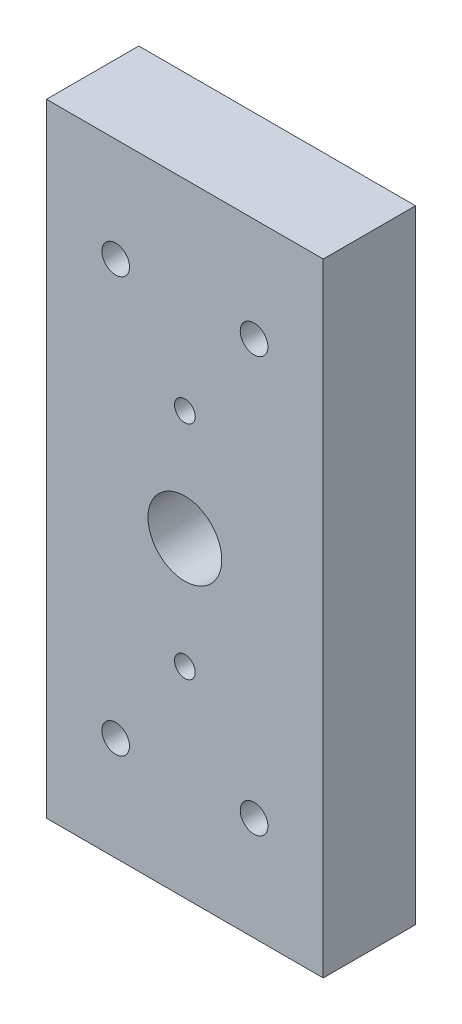
ISO-10303-21;
HEADER;
FILE_DESCRIPTION(('STEP AP214'),'2;1');
FILE_NAME('part.step','',(''),(''),'','','');
FILE_SCHEMA(('AUTOMOTIVE_DESIGN { 1 0 10303 214 1 1 1 1 }'));
ENDSEC;
DATA;
#1=APPLICATION_CONTEXT('core data for automotive mechanical design processes');
#2=APPLICATION_PROTOCOL_DEFINITION('international standard','automotive_design',2000,#1);
#3=PRODUCT_CONTEXT('',#1,'mechanical');
#4=PRODUCT('Part','Part','',(#3));
#5=PRODUCT_RELATED_PRODUCT_CATEGORY('part','',(#4));
#6=PRODUCT_DEFINITION_FORMATION('','',#4);
#7=PRODUCT_DEFINITION_CONTEXT('part definition',#1,'design');
#8=PRODUCT_DEFINITION('design','',#6,#7);
#9=PRODUCT_DEFINITION_SHAPE('','',#8);
#10=(LENGTH_UNIT() NAMED_UNIT(*) SI_UNIT(.MILLI.,.METRE.));
#11=(NAMED_UNIT(*) PLANE_ANGLE_UNIT() SI_UNIT($,.RADIAN.));
#12=(NAMED_UNIT(*) SI_UNIT($,.STERADIAN.) SOLID_ANGLE_UNIT());
#13=UNCERTAINTY_MEASURE_WITH_UNIT(LENGTH_MEASURE(1.E-05),#10,'distance_accuracy_value','');
#14=(GEOMETRIC_REPRESENTATION_CONTEXT(3) GLOBAL_UNCERTAINTY_ASSIGNED_CONTEXT((#13)) GLOBAL_UNIT_ASSIGNED_CONTEXT((#10,
#11,#12)) REPRESENTATION_CONTEXT('',''));
#15=CARTESIAN_POINT('',(0.,0.,0.));
#16=DIRECTION('',(0.,0.,1.));
#17=DIRECTION('',(1.,0.,0.));
#18=AXIS2_PLACEMENT_3D('',#15,#16,#17);
#19=CARTESIAN_POINT('',(5.,22.5,20.));
#20=DIRECTION('',(0.,0.,-1.));
#21=DIRECTION('',(-1.,0.,0.));
#22=AXIS2_PLACEMENT_3D('',#19,#20,#21);
#23=CYLINDRICAL_SURFACE('',#22,3.);
#24=CARTESIAN_POINT('',(5.,22.5,20.));
#25=DIRECTION('',(0.,0.,1.));
#26=DIRECTION('',(1.,0.,0.));
#27=AXIS2_PLACEMENT_3D('',#24,#25,#26);
#28=CIRCLE('',#27,3.);
#29=CARTESIAN_POINT('',(8.,22.5,20.));
#30=VERTEX_POINT('',#29);
#31=EDGE_CURVE('E107',#30,#30,#28,.T.);
#32=ORIENTED_EDGE('',*,*,#31,.T.);
#33=EDGE_LOOP('',(#32));
#34=FACE_BOUND('',#33,.T.);
#35=CARTESIAN_POINT('',(5.,22.5,6.));
#36=DIRECTION('',(0.,0.,-1.));
#37=DIRECTION('',(-1.,0.,0.));
#38=AXIS2_PLACEMENT_3D('',#35,#36,#37);
#39=CIRCLE('',#38,3.);
#40=CARTESIAN_POINT('',(2.,22.5,6.));
#41=VERTEX_POINT('',#40);
#42=EDGE_CURVE('E32',#41,#41,#39,.T.);
#43=ORIENTED_EDGE('',*,*,#42,.T.);
#44=EDGE_LOOP('',(#43));
#45=FACE_BOUND('',#44,.T.);
#46=ADVANCED_FACE('F28',(#34,#45),#23,.F.);
#47=CARTESIAN_POINT('',(35.,22.5,20.));
#48=DIRECTION('',(0.,0.,-1.));
#49=DIRECTION('',(-1.,0.,0.));
#50=AXIS2_PLACEMENT_3D('',#47,#48,#49);
#51=CYLINDRICAL_SURFACE('',#50,3.);
#52=CARTESIAN_POINT('',(35.,22.5,20.));
#53=DIRECTION('',(0.,0.,1.));
#54=DIRECTION('',(1.,0.,0.));
#55=AXIS2_PLACEMENT_3D('',#52,#53,#54);
#56=CIRCLE('',#55,3.);
#57=CARTESIAN_POINT('',(38.,22.5,20.));
#58=VERTEX_POINT('',#57);
#59=EDGE_CURVE('E104',#58,#58,#56,.T.);
#60=ORIENTED_EDGE('',*,*,#59,.T.);
#61=EDGE_LOOP('',(#60));
#62=FACE_BOUND('',#61,.T.);
#63=CARTESIAN_POINT('',(35.,22.5,6.));
#64=DIRECTION('',(0.,0.,-1.));
#65=DIRECTION('',(-1.,0.,0.));
#66=AXIS2_PLACEMENT_3D('',#63,#64,#65);
#67=CIRCLE('',#66,3.);
#68=CARTESIAN_POINT('',(32.,22.5,6.));
#69=VERTEX_POINT('',#68);
#70=EDGE_CURVE('E135',#69,#69,#67,.T.);
#71=ORIENTED_EDGE('',*,*,#70,.T.);
#72=EDGE_LOOP('',(#71));
#73=FACE_BOUND('',#72,.T.);
#74=ADVANCED_FACE('F174',(#62,#73),#51,.F.);
#75=CARTESIAN_POINT('',(5.,112.5,20.));
#76=DIRECTION('',(0.,0.,-1.));
#77=DIRECTION('',(-1.,0.,0.));
#78=AXIS2_PLACEMENT_3D('',#75,#76,#77);
#79=CYLINDRICAL_SURFACE('',#78,3.);
#80=CARTESIAN_POINT('',(5.,112.5,20.));
#81=DIRECTION('',(0.,0.,1.));
#82=DIRECTION('',(1.,0.,0.));
#83=AXIS2_PLACEMENT_3D('',#80,#81,#82);
#84=CIRCLE('',#83,3.);
#85=CARTESIAN_POINT('',(8.,112.5,20.));
#86=VERTEX_POINT('',#85);
#87=EDGE_CURVE('E113',#86,#86,#84,.T.);
#88=ORIENTED_EDGE('',*,*,#87,.T.);
#89=EDGE_LOOP('',(#88));
#90=FACE_BOUND('',#89,.T.);
#91=CARTESIAN_POINT('',(5.,112.5,6.));
#92=DIRECTION('',(0.,0.,-1.));
#93=DIRECTION('',(-1.,0.,0.));
#94=AXIS2_PLACEMENT_3D('',#91,#92,#93);
#95=CIRCLE('',#94,3.);
#96=CARTESIAN_POINT('',(2.,112.5,6.));
#97=VERTEX_POINT('',#96);
#98=EDGE_CURVE('E131',#97,#97,#95,.T.);
#99=ORIENTED_EDGE('',*,*,#98,.T.);
#100=EDGE_LOOP('',(#99));
#101=FACE_BOUND('',#100,.T.);
#102=ADVANCED_FACE('F180',(#90,#101),#79,.F.);
#103=CARTESIAN_POINT('',(35.,112.5,20.));
#104=DIRECTION('',(0.,0.,-1.));
#105=DIRECTION('',(-1.,0.,0.));
#106=AXIS2_PLACEMENT_3D('',#103,#104,#105);
#107=CYLINDRICAL_SURFACE('',#106,3.);
#108=CARTESIAN_POINT('',(35.,112.5,20.));
#109=DIRECTION('',(0.,0.,1.));
#110=DIRECTION('',(1.,0.,0.));
#111=AXIS2_PLACEMENT_3D('',#108,#109,#110);
#112=CIRCLE('',#111,3.);
#113=CARTESIAN_POINT('',(38.,112.5,20.));
#114=VERTEX_POINT('',#113);
#115=EDGE_CURVE('E110',#114,#114,#112,.T.);
#116=ORIENTED_EDGE('',*,*,#115,.T.);
#117=EDGE_LOOP('',(#116));
#118=FACE_BOUND('',#117,.T.);
#119=CARTESIAN_POINT('',(35.,112.5,6.));
#120=DIRECTION('',(0.,0.,-1.));
#121=DIRECTION('',(-1.,0.,0.));
#122=AXIS2_PLACEMENT_3D('',#119,#120,#121);
#123=CIRCLE('',#122,3.);
#124=CARTESIAN_POINT('',(32.,112.5,6.));
#125=VERTEX_POINT('',#124);
#126=EDGE_CURVE('E127',#125,#125,#123,.T.);
#127=ORIENTED_EDGE('',*,*,#126,.T.);
#128=EDGE_LOOP('',(#127));
#129=FACE_BOUND('',#128,.T.);
#130=ADVANCED_FACE('F185',(#118,#129),#107,.F.);
#131=CARTESIAN_POINT('',(-10.,-47.5506246430063,20.));
#132=DIRECTION('',(1.,0.,0.));
#133=DIRECTION('',(0.,0.,-1.));
#134=AXIS2_PLACEMENT_3D('',#131,#132,#133);
#135=PLANE('',#134);
#136=DIRECTION('',(0.,-1.,0.));
#137=VECTOR('',#136,1.);
#138=CARTESIAN_POINT('',(-10.,-47.5506246430063,0.));
#139=LINE('',#138,#137);
#140=CARTESIAN_POINT('',(-10.,135.,0.));
#141=VERTEX_POINT('',#140);
#142=CARTESIAN_POINT('',(-10.,0.,0.));
#143=VERTEX_POINT('',#142);
#144=EDGE_CURVE('E75',#141,#143,#139,.T.);
#145=ORIENTED_EDGE('',*,*,#144,.T.);
#146=DIRECTION('',(0.,0.,-1.));
#147=VECTOR('',#146,1.);
#148=CARTESIAN_POINT('',(-10.,0.,20.));
#149=LINE('',#148,#147);
#150=CARTESIAN_POINT('',(-10.,0.,20.));
#151=VERTEX_POINT('',#150);
#152=EDGE_CURVE('E11',#151,#143,#149,.T.);
#153=ORIENTED_EDGE('',*,*,#152,.F.);
#154=DIRECTION('',(0.,-1.,0.));
#155=VECTOR('',#154,1.);
#156=CARTESIAN_POINT('',(-10.,-47.5506246430063,20.));
#157=LINE('',#156,#155);
#158=CARTESIAN_POINT('',(-10.,135.,20.));
#159=VERTEX_POINT('',#158);
#160=EDGE_CURVE('E116',#159,#151,#157,.T.);
#161=ORIENTED_EDGE('',*,*,#160,.F.);
#162=DIRECTION('',(0.,0.,-1.));
#163=VECTOR('',#162,1.);
#164=CARTESIAN_POINT('',(-10.,135.,20.));
#165=LINE('',#164,#163);
#166=EDGE_CURVE('E45',#159,#141,#165,.T.);
#167=ORIENTED_EDGE('',*,*,#166,.T.);
#168=EDGE_LOOP('',(#145,#153,#161,#167));
#169=FACE_BOUND('',#168,.T.);
#170=ADVANCED_FACE('F87',(#169),#135,.F.);
#171=CARTESIAN_POINT('',(20.,0.,20.));
#172=DIRECTION('',(0.,1.,0.));
#173=DIRECTION('',(0.,0.,1.));
#174=AXIS2_PLACEMENT_3D('',#171,#172,#173);
#175=PLANE('',#174);
#176=DIRECTION('',(0.,0.,-1.));
#177=VECTOR('',#176,1.);
#178=CARTESIAN_POINT('',(50.,0.,20.));
#179=LINE('',#178,#177);
#180=CARTESIAN_POINT('',(50.,0.,20.));
#181=VERTEX_POINT('',#180);
#182=CARTESIAN_POINT('',(50.,0.,0.));
#183=VERTEX_POINT('',#182);
#184=EDGE_CURVE('E37',#181,#183,#179,.T.);
#185=ORIENTED_EDGE('',*,*,#184,.F.);
#186=DIRECTION('',(1.,0.,0.));
#187=VECTOR('',#186,1.);
#188=CARTESIAN_POINT('',(20.,0.,20.));
#189=LINE('',#188,#187);
#190=EDGE_CURVE('E84',#151,#181,#189,.T.);
#191=ORIENTED_EDGE('',*,*,#190,.F.);
#192=ORIENTED_EDGE('',*,*,#152,.T.);
#193=DIRECTION('',(1.,0.,0.));
#194=VECTOR('',#193,1.);
#195=CARTESIAN_POINT('',(20.,0.,0.));
#196=LINE('',#195,#194);
#197=EDGE_CURVE('E71',#143,#183,#196,.T.);
#198=ORIENTED_EDGE('',*,*,#197,.T.);
#199=EDGE_LOOP('',(#185,#191,#192,#198));
#200=FACE_BOUND('',#199,.T.);
#201=ADVANCED_FACE('F83',(#200),#175,.F.);
#202=CARTESIAN_POINT('',(50.,-47.5506246430063,20.));
#203=DIRECTION('',(1.,0.,0.));
#204=DIRECTION('',(0.,0.,-1.));
#205=AXIS2_PLACEMENT_3D('',#202,#203,#204);
#206=PLANE('',#205);
#207=DIRECTION('',(0.,-1.,0.));
#208=VECTOR('',#207,1.);
#209=CARTESIAN_POINT('',(50.,-47.5506246430063,0.));
#210=LINE('',#209,#208);
#211=CARTESIAN_POINT('',(50.,135.,0.));
#212=VERTEX_POINT('',#211);
#213=EDGE_CURVE('E77',#212,#183,#210,.T.);
#214=ORIENTED_EDGE('',*,*,#213,.F.);
#215=DIRECTION('',(0.,0.,-1.));
#216=VECTOR('',#215,1.);
#217=CARTESIAN_POINT('',(50.,135.,20.));
#218=LINE('',#217,#216);
#219=CARTESIAN_POINT('',(50.,135.,20.));
#220=VERTEX_POINT('',#219);
#221=EDGE_CURVE('E124',#220,#212,#218,.T.);
#222=ORIENTED_EDGE('',*,*,#221,.F.);
#223=DIRECTION('',(0.,-1.,0.));
#224=VECTOR('',#223,1.);
#225=CARTESIAN_POINT('',(50.,-47.5506246430063,20.));
#226=LINE('',#225,#224);
#227=EDGE_CURVE('E119',#220,#181,#226,.T.);
#228=ORIENTED_EDGE('',*,*,#227,.T.);
#229=ORIENTED_EDGE('',*,*,#184,.T.);
#230=EDGE_LOOP('',(#214,#222,#228,#229));
#231=FACE_BOUND('',#230,.T.);
#232=ADVANCED_FACE('F172',(#231),#206,.T.);
#233=CARTESIAN_POINT('',(20.0001310269614,91.4999437200018,20.));
#234=DIRECTION('',(0.,0.,-1.));
#235=DIRECTION('',(-1.,0.,0.));
#236=AXIS2_PLACEMENT_3D('',#233,#234,#235);
#237=CYLINDRICAL_SURFACE('',#236,2.25);
#238=CARTESIAN_POINT('',(20.0001310269614,91.4999437200018,20.));
#239=DIRECTION('',(0.,0.,1.));
#240=DIRECTION('',(1.,0.,0.));
#241=AXIS2_PLACEMENT_3D('',#238,#239,#240);
#242=CIRCLE('',#241,2.25);
#243=CARTESIAN_POINT('',(22.2501310269614,91.4999437200018,20.));
#244=VERTEX_POINT('',#243);
#245=EDGE_CURVE('E101',#244,#244,#242,.T.);
#246=ORIENTED_EDGE('',*,*,#245,.T.);
#247=EDGE_LOOP('',(#246));
#248=FACE_BOUND('',#247,.T.);
#249=CARTESIAN_POINT('',(20.0001310269614,91.4999437200018,0.));
#250=DIRECTION('',(0.,0.,1.));
#251=DIRECTION('',(1.,0.,0.));
#252=AXIS2_PLACEMENT_3D('',#249,#250,#251);
#253=CIRCLE('',#252,2.25);
#254=CARTESIAN_POINT('',(22.2501310269614,91.4999437200018,0.));
#255=VERTEX_POINT('',#254);
#256=EDGE_CURVE('E88',#255,#255,#253,.T.);
#257=ORIENTED_EDGE('',*,*,#256,.F.);
#258=EDGE_LOOP('',(#257));
#259=FACE_BOUND('',#258,.T.);
#260=ADVANCED_FACE('F163',(#248,#259),#237,.F.);
#261=CARTESIAN_POINT('',(20.0001310269613,43.4999345889699,20.));
#262=DIRECTION('',(0.,0.,-1.));
#263=DIRECTION('',(-1.,0.,0.));
#264=AXIS2_PLACEMENT_3D('',#261,#262,#263);
#265=CYLINDRICAL_SURFACE('',#264,2.25);
#266=CARTESIAN_POINT('',(20.0001310269613,43.4999345889699,20.));
#267=DIRECTION('',(0.,0.,1.));
#268=DIRECTION('',(1.,0.,0.));
#269=AXIS2_PLACEMENT_3D('',#266,#267,#268);
#270=CIRCLE('',#269,2.25);
#271=CARTESIAN_POINT('',(22.2501310269613,43.4999345889699,20.));
#272=VERTEX_POINT('',#271);
#273=EDGE_CURVE('E98',#272,#272,#270,.T.);
#274=ORIENTED_EDGE('',*,*,#273,.T.);
#275=EDGE_LOOP('',(#274));
#276=FACE_BOUND('',#275,.T.);
#277=CARTESIAN_POINT('',(20.0001310269613,43.4999345889699,0.));
#278=DIRECTION('',(0.,0.,1.));
#279=DIRECTION('',(1.,0.,0.));
#280=AXIS2_PLACEMENT_3D('',#277,#278,#279);
#281=CIRCLE('',#280,2.25);
#282=CARTESIAN_POINT('',(22.2501310269613,43.4999345889699,0.));
#283=VERTEX_POINT('',#282);
#284=EDGE_CURVE('E91',#283,#283,#281,.T.);
#285=ORIENTED_EDGE('',*,*,#284,.F.);
#286=EDGE_LOOP('',(#285));
#287=FACE_BOUND('',#286,.T.);
#288=ADVANCED_FACE('F30',(#276,#287),#265,.F.);
#289=CARTESIAN_POINT('',(20.,135.,20.));
#290=DIRECTION('',(0.,1.,0.));
#291=DIRECTION('',(0.,0.,1.));
#292=AXIS2_PLACEMENT_3D('',#289,#290,#291);
#293=PLANE('',#292);
#294=ORIENTED_EDGE('',*,*,#221,.T.);
#295=DIRECTION('',(1.,0.,0.));
#296=VECTOR('',#295,1.);
#297=CARTESIAN_POINT('',(20.,135.,0.));
#298=LINE('',#297,#296);
#299=EDGE_CURVE('E96',#141,#212,#298,.T.);
#300=ORIENTED_EDGE('',*,*,#299,.F.);
#301=ORIENTED_EDGE('',*,*,#166,.F.);
#302=DIRECTION('',(1.,0.,0.));
#303=VECTOR('',#302,1.);
#304=CARTESIAN_POINT('',(20.,135.,20.));
#305=LINE('',#304,#303);
#306=EDGE_CURVE('E50',#159,#220,#305,.T.);
#307=ORIENTED_EDGE('',*,*,#306,.T.);
#308=EDGE_LOOP('',(#294,#300,#301,#307));
#309=FACE_BOUND('',#308,.T.);
#310=ADVANCED_FACE('F162',(#309),#293,.T.);
#311=CARTESIAN_POINT('',(20.,-47.5506246430063,20.));
#312=DIRECTION('',(0.,0.,1.));
#313=DIRECTION('',(1.,0.,0.));
#314=AXIS2_PLACEMENT_3D('',#311,#312,#313);
#315=PLANE('',#314);
#316=ORIENTED_EDGE('',*,*,#227,.F.);
#317=ORIENTED_EDGE('',*,*,#306,.F.);
#318=ORIENTED_EDGE('',*,*,#160,.T.);
#319=ORIENTED_EDGE('',*,*,#190,.T.);
#320=EDGE_LOOP('',(#316,#317,#318,#319));
#321=FACE_BOUND('',#320,.T.);
#322=CARTESIAN_POINT('',(20.,67.5,20.));
#323=DIRECTION('',(0.,0.,-1.));
#324=DIRECTION('',(-1.,0.,0.));
#325=AXIS2_PLACEMENT_3D('',#322,#323,#324);
#326=CIRCLE('',#325,8.);
#327=CARTESIAN_POINT('',(12.,67.5,20.));
#328=VERTEX_POINT('',#327);
#329=EDGE_CURVE('E245',#328,#328,#326,.T.);
#330=ORIENTED_EDGE('',*,*,#329,.T.);
#331=EDGE_LOOP('',(#330));
#332=FACE_BOUND('',#331,.T.);
#333=ORIENTED_EDGE('',*,*,#273,.F.);
#334=EDGE_LOOP('',(#333));
#335=FACE_BOUND('',#334,.T.);
#336=ORIENTED_EDGE('',*,*,#245,.F.);
#337=EDGE_LOOP('',(#336));
#338=FACE_BOUND('',#337,.T.);
#339=ORIENTED_EDGE('',*,*,#59,.F.);
#340=EDGE_LOOP('',(#339));
#341=FACE_BOUND('',#340,.T.);
#342=ORIENTED_EDGE('',*,*,#31,.F.);
#343=EDGE_LOOP('',(#342));
#344=FACE_BOUND('',#343,.T.);
#345=ORIENTED_EDGE('',*,*,#115,.F.);
#346=EDGE_LOOP('',(#345));
#347=FACE_BOUND('',#346,.T.);
#348=ORIENTED_EDGE('',*,*,#87,.F.);
#349=EDGE_LOOP('',(#348));
#350=FACE_BOUND('',#349,.T.);
#351=ADVANCED_FACE('F170',(#321,#332,#335,#338,#341,#344,#347,#350),#315,.T.);
#352=CARTESIAN_POINT('',(20.,-47.5506246430063,0.));
#353=DIRECTION('',(0.,0.,1.));
#354=DIRECTION('',(1.,0.,0.));
#355=AXIS2_PLACEMENT_3D('',#352,#353,#354);
#356=PLANE('',#355);
#357=CARTESIAN_POINT('',(5.,22.5,0.));
#358=DIRECTION('',(0.,0.,-1.));
#359=DIRECTION('',(-1.,0.,0.));
#360=AXIS2_PLACEMENT_3D('',#357,#358,#359);
#361=CIRCLE('',#360,5.);
#362=CARTESIAN_POINT('',(0.,22.5,0.));
#363=VERTEX_POINT('',#362);
#364=EDGE_CURVE('E251',#363,#363,#361,.T.);
#365=ORIENTED_EDGE('',*,*,#364,.F.);
#366=EDGE_LOOP('',(#365));
#367=FACE_BOUND('',#366,.T.);
#368=CARTESIAN_POINT('',(5.,112.5,0.));
#369=DIRECTION('',(0.,0.,-1.));
#370=DIRECTION('',(-1.,0.,0.));
#371=AXIS2_PLACEMENT_3D('',#368,#369,#370);
#372=CIRCLE('',#371,5.);
#373=CARTESIAN_POINT('',(0.,112.5,0.));
#374=VERTEX_POINT('',#373);
#375=EDGE_CURVE('E137',#374,#374,#372,.T.);
#376=ORIENTED_EDGE('',*,*,#375,.F.);
#377=EDGE_LOOP('',(#376));
#378=FACE_BOUND('',#377,.T.);
#379=CARTESIAN_POINT('',(35.,112.5,0.));
#380=DIRECTION('',(0.,0.,-1.));
#381=DIRECTION('',(-1.,0.,0.));
#382=AXIS2_PLACEMENT_3D('',#379,#380,#381);
#383=CIRCLE('',#382,5.);
#384=CARTESIAN_POINT('',(30.,112.5,0.));
#385=VERTEX_POINT('',#384);
#386=EDGE_CURVE('E133',#385,#385,#383,.T.);
#387=ORIENTED_EDGE('',*,*,#386,.F.);
#388=EDGE_LOOP('',(#387));
#389=FACE_BOUND('',#388,.T.);
#390=CARTESIAN_POINT('',(35.,22.5,0.));
#391=DIRECTION('',(0.,0.,-1.));
#392=DIRECTION('',(-1.,0.,0.));
#393=AXIS2_PLACEMENT_3D('',#390,#391,#392);
#394=CIRCLE('',#393,5.);
#395=CARTESIAN_POINT('',(30.,22.5,0.));
#396=VERTEX_POINT('',#395);
#397=EDGE_CURVE('E144',#396,#396,#394,.T.);
#398=ORIENTED_EDGE('',*,*,#397,.F.);
#399=EDGE_LOOP('',(#398));
#400=FACE_BOUND('',#399,.T.);
#401=CARTESIAN_POINT('',(20.,67.5,0.));
#402=DIRECTION('',(0.,0.,-1.));
#403=DIRECTION('',(-1.,0.,0.));
#404=AXIS2_PLACEMENT_3D('',#401,#402,#403);
#405=CIRCLE('',#404,8.);
#406=CARTESIAN_POINT('',(12.,67.5,0.));
#407=VERTEX_POINT('',#406);
#408=EDGE_CURVE('E248',#407,#407,#405,.T.);
#409=ORIENTED_EDGE('',*,*,#408,.F.);
#410=EDGE_LOOP('',(#409));
#411=FACE_BOUND('',#410,.T.);
#412=ORIENTED_EDGE('',*,*,#213,.T.);
#413=ORIENTED_EDGE('',*,*,#197,.F.);
#414=ORIENTED_EDGE('',*,*,#144,.F.);
#415=ORIENTED_EDGE('',*,*,#299,.T.);
#416=EDGE_LOOP('',(#412,#413,#414,#415));
#417=FACE_BOUND('',#416,.T.);
#418=ORIENTED_EDGE('',*,*,#284,.T.);
#419=EDGE_LOOP('',(#418));
#420=FACE_BOUND('',#419,.T.);
#421=ORIENTED_EDGE('',*,*,#256,.T.);
#422=EDGE_LOOP('',(#421));
#423=FACE_BOUND('',#422,.T.);
#424=ADVANCED_FACE('F72',(#367,#378,#389,#400,#411,#417,#420,#423),#356,.F.);
#425=CARTESIAN_POINT('',(35.,112.5,6.));
#426=DIRECTION('',(0.,0.,-1.));
#427=DIRECTION('',(-1.,0.,0.));
#428=AXIS2_PLACEMENT_3D('',#425,#426,#427);
#429=CYLINDRICAL_SURFACE('',#428,5.);
#430=CARTESIAN_POINT('',(35.,112.5,6.));
#431=DIRECTION('',(0.,0.,-1.));
#432=DIRECTION('',(-1.,0.,0.));
#433=AXIS2_PLACEMENT_3D('',#430,#431,#432);
#434=CIRCLE('',#433,5.);
#435=CARTESIAN_POINT('',(30.,112.5,6.));
#436=VERTEX_POINT('',#435);
#437=EDGE_CURVE('E130',#436,#436,#434,.T.);
#438=ORIENTED_EDGE('',*,*,#437,.F.);
#439=EDGE_LOOP('',(#438));
#440=FACE_BOUND('',#439,.T.);
#441=ORIENTED_EDGE('',*,*,#386,.T.);
#442=EDGE_LOOP('',(#441));
#443=FACE_BOUND('',#442,.T.);
#444=ADVANCED_FACE('F204',(#440,#443),#429,.F.);
#445=CARTESIAN_POINT('',(35.,112.5,6.));
#446=DIRECTION('',(0.,0.,-1.));
#447=DIRECTION('',(-1.,0.,0.));
#448=AXIS2_PLACEMENT_3D('',#445,#446,#447);
#449=PLANE('',#448);
#450=ORIENTED_EDGE('',*,*,#126,.F.);
#451=EDGE_LOOP('',(#450));
#452=FACE_BOUND('',#451,.T.);
#453=ORIENTED_EDGE('',*,*,#437,.T.);
#454=EDGE_LOOP('',(#453));
#455=FACE_BOUND('',#454,.T.);
#456=ADVANCED_FACE('F208',(#452,#455),#449,.T.);
#457=CARTESIAN_POINT('',(5.,112.5,6.));
#458=DIRECTION('',(0.,0.,-1.));
#459=DIRECTION('',(-1.,0.,0.));
#460=AXIS2_PLACEMENT_3D('',#457,#458,#459);
#461=CYLINDRICAL_SURFACE('',#460,5.);
#462=CARTESIAN_POINT('',(5.,112.5,6.));
#463=DIRECTION('',(0.,0.,-1.));
#464=DIRECTION('',(-1.,0.,0.));
#465=AXIS2_PLACEMENT_3D('',#462,#463,#464);
#466=CIRCLE('',#465,5.);
#467=CARTESIAN_POINT('',(0.,112.5,6.));
#468=VERTEX_POINT('',#467);
#469=EDGE_CURVE('E134',#468,#468,#466,.T.);
#470=ORIENTED_EDGE('',*,*,#469,.F.);
#471=EDGE_LOOP('',(#470));
#472=FACE_BOUND('',#471,.T.);
#473=ORIENTED_EDGE('',*,*,#375,.T.);
#474=EDGE_LOOP('',(#473));
#475=FACE_BOUND('',#474,.T.);
#476=ADVANCED_FACE('F212',(#472,#475),#461,.F.);
#477=CARTESIAN_POINT('',(5.,112.5,6.));
#478=DIRECTION('',(0.,0.,-1.));
#479=DIRECTION('',(-1.,0.,0.));
#480=AXIS2_PLACEMENT_3D('',#477,#478,#479);
#481=PLANE('',#480);
#482=ORIENTED_EDGE('',*,*,#98,.F.);
#483=EDGE_LOOP('',(#482));
#484=FACE_BOUND('',#483,.T.);
#485=ORIENTED_EDGE('',*,*,#469,.T.);
#486=EDGE_LOOP('',(#485));
#487=FACE_BOUND('',#486,.T.);
#488=ADVANCED_FACE('F216',(#484,#487),#481,.T.);
#489=CARTESIAN_POINT('',(35.,22.5,6.));
#490=DIRECTION('',(0.,0.,-1.));
#491=DIRECTION('',(-1.,0.,0.));
#492=AXIS2_PLACEMENT_3D('',#489,#490,#491);
#493=CYLINDRICAL_SURFACE('',#492,5.);
#494=CARTESIAN_POINT('',(35.,22.5,6.));
#495=DIRECTION('',(0.,0.,-1.));
#496=DIRECTION('',(-1.,0.,0.));
#497=AXIS2_PLACEMENT_3D('',#494,#495,#496);
#498=CIRCLE('',#497,5.);
#499=CARTESIAN_POINT('',(30.,22.5,6.));
#500=VERTEX_POINT('',#499);
#501=EDGE_CURVE('E138',#500,#500,#498,.T.);
#502=ORIENTED_EDGE('',*,*,#501,.F.);
#503=EDGE_LOOP('',(#502));
#504=FACE_BOUND('',#503,.T.);
#505=ORIENTED_EDGE('',*,*,#397,.T.);
#506=EDGE_LOOP('',(#505));
#507=FACE_BOUND('',#506,.T.);
#508=ADVANCED_FACE('F220',(#504,#507),#493,.F.);
#509=CARTESIAN_POINT('',(35.,22.5,6.));
#510=DIRECTION('',(0.,0.,-1.));
#511=DIRECTION('',(-1.,0.,0.));
#512=AXIS2_PLACEMENT_3D('',#509,#510,#511);
#513=PLANE('',#512);
#514=ORIENTED_EDGE('',*,*,#70,.F.);
#515=EDGE_LOOP('',(#514));
#516=FACE_BOUND('',#515,.T.);
#517=ORIENTED_EDGE('',*,*,#501,.T.);
#518=EDGE_LOOP('',(#517));
#519=FACE_BOUND('',#518,.T.);
#520=ADVANCED_FACE('F224',(#516,#519),#513,.T.);
#521=CARTESIAN_POINT('',(5.,22.5,6.));
#522=DIRECTION('',(0.,0.,-1.));
#523=DIRECTION('',(-1.,0.,0.));
#524=AXIS2_PLACEMENT_3D('',#521,#522,#523);
#525=CYLINDRICAL_SURFACE('',#524,5.);
#526=CARTESIAN_POINT('',(5.,22.5,6.));
#527=DIRECTION('',(0.,0.,-1.));
#528=DIRECTION('',(-1.,0.,0.));
#529=AXIS2_PLACEMENT_3D('',#526,#527,#528);
#530=CIRCLE('',#529,5.);
#531=CARTESIAN_POINT('',(0.,22.5,6.));
#532=VERTEX_POINT('',#531);
#533=EDGE_CURVE('E255',#532,#532,#530,.T.);
#534=ORIENTED_EDGE('',*,*,#533,.F.);
#535=EDGE_LOOP('',(#534));
#536=FACE_BOUND('',#535,.T.);
#537=ORIENTED_EDGE('',*,*,#364,.T.);
#538=EDGE_LOOP('',(#537));
#539=FACE_BOUND('',#538,.T.);
#540=ADVANCED_FACE('F228',(#536,#539),#525,.F.);
#541=CARTESIAN_POINT('',(5.,22.5,6.));
#542=DIRECTION('',(0.,0.,-1.));
#543=DIRECTION('',(-1.,0.,0.));
#544=AXIS2_PLACEMENT_3D('',#541,#542,#543);
#545=PLANE('',#544);
#546=ORIENTED_EDGE('',*,*,#42,.F.);
#547=EDGE_LOOP('',(#546));
#548=FACE_BOUND('',#547,.T.);
#549=ORIENTED_EDGE('',*,*,#533,.T.);
#550=EDGE_LOOP('',(#549));
#551=FACE_BOUND('',#550,.T.);
#552=ADVANCED_FACE('F232',(#548,#551),#545,.T.);
#553=CARTESIAN_POINT('',(20.,67.5,20.));
#554=DIRECTION('',(0.,0.,-1.));
#555=DIRECTION('',(-1.,0.,0.));
#556=AXIS2_PLACEMENT_3D('',#553,#554,#555);
#557=CYLINDRICAL_SURFACE('',#556,8.);
#558=ORIENTED_EDGE('',*,*,#329,.F.);
#559=EDGE_LOOP('',(#558));
#560=FACE_BOUND('',#559,.T.);
#561=ORIENTED_EDGE('',*,*,#408,.T.);
#562=EDGE_LOOP('',(#561));
#563=FACE_BOUND('',#562,.T.);
#564=ADVANCED_FACE('F236',(#560,#563),#557,.F.);
#565=CLOSED_SHELL('',(#46,#74,#102,#130,#170,#201,#232,#260,#288,#310,#351,#424,#444,#456,#476,
#488,#508,#520,#540,#552,#564));
#566=MANIFOLD_SOLID_BREP('B2',#565);
#567=ADVANCED_BREP_SHAPE_REPRESENTATION('',(#18,#566),#14);
#568=SHAPE_DEFINITION_REPRESENTATION(#9,#567);
ENDSEC;
END-ISO-10303-21;
